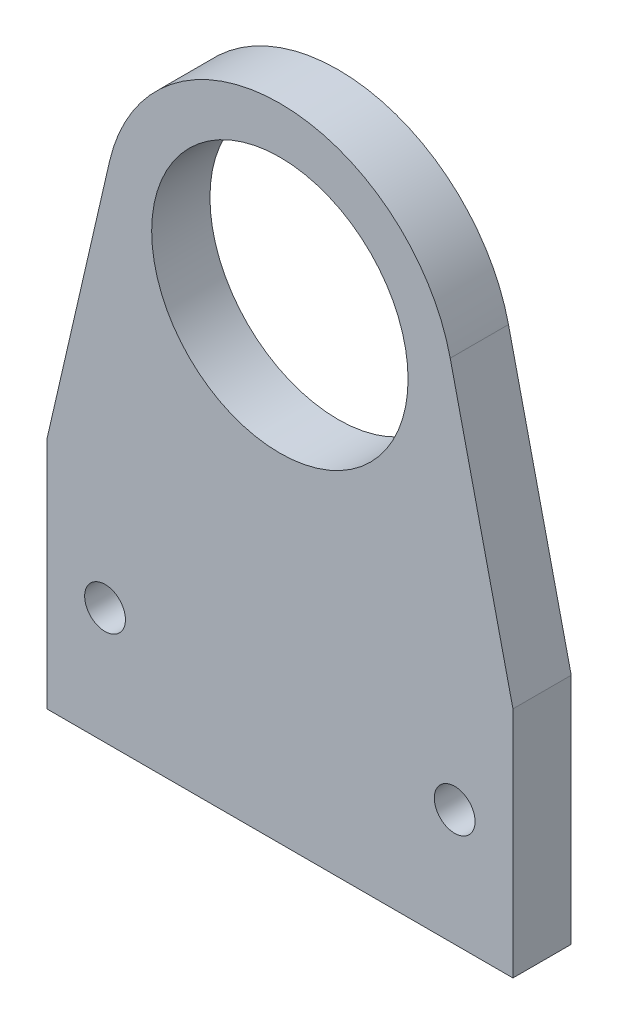
ISO-10303-21;
HEADER;
FILE_DESCRIPTION(('STEP AP214'),'2;1');
FILE_NAME('part.step','',(''),(''),'','','');
FILE_SCHEMA(('AUTOMOTIVE_DESIGN { 1 0 10303 214 1 1 1 1 }'));
ENDSEC;
DATA;
#1=APPLICATION_CONTEXT('core data for automotive mechanical design processes');
#2=APPLICATION_PROTOCOL_DEFINITION('international standard','automotive_design',2000,#1);
#3=PRODUCT_CONTEXT('',#1,'mechanical');
#4=PRODUCT('Part','Part','',(#3));
#5=PRODUCT_RELATED_PRODUCT_CATEGORY('part','',(#4));
#6=PRODUCT_DEFINITION_FORMATION('','',#4);
#7=PRODUCT_DEFINITION_CONTEXT('part definition',#1,'design');
#8=PRODUCT_DEFINITION('design','',#6,#7);
#9=PRODUCT_DEFINITION_SHAPE('','',#8);
#10=(LENGTH_UNIT() NAMED_UNIT(*) SI_UNIT(.MILLI.,.METRE.));
#11=(NAMED_UNIT(*) PLANE_ANGLE_UNIT() SI_UNIT($,.RADIAN.));
#12=(NAMED_UNIT(*) SI_UNIT($,.STERADIAN.) SOLID_ANGLE_UNIT());
#13=UNCERTAINTY_MEASURE_WITH_UNIT(LENGTH_MEASURE(1.E-05),#10,'distance_accuracy_value','');
#14=(GEOMETRIC_REPRESENTATION_CONTEXT(3) GLOBAL_UNCERTAINTY_ASSIGNED_CONTEXT((#13)) GLOBAL_UNIT_ASSIGNED_CONTEXT((#10,
#11,#12)) REPRESENTATION_CONTEXT('',''));
#15=CARTESIAN_POINT('',(0.,0.,0.));
#16=DIRECTION('',(0.,0.,1.));
#17=DIRECTION('',(1.,0.,0.));
#18=AXIS2_PLACEMENT_3D('',#15,#16,#17);
#19=CARTESIAN_POINT('',(0.,20.,5.));
#20=DIRECTION('',(0.,0.,1.));
#21=DIRECTION('',(1.,0.,0.));
#22=AXIS2_PLACEMENT_3D('',#19,#20,#21);
#23=PLANE('',#22);
#24=CARTESIAN_POINT('',(-15.,-10.,5.));
#25=DIRECTION('',(0.,0.,1.));
#26=DIRECTION('',(1.,0.,0.));
#27=AXIS2_PLACEMENT_3D('',#24,#25,#26);
#28=CIRCLE('',#27,1.75);
#29=CARTESIAN_POINT('',(-13.25,-10.,5.));
#30=VERTEX_POINT('',#29);
#31=EDGE_CURVE('E207',#30,#30,#28,.T.);
#32=ORIENTED_EDGE('',*,*,#31,.F.);
#33=EDGE_LOOP('',(#32));
#34=FACE_BOUND('',#33,.T.);
#35=CARTESIAN_POINT('',(0.,20.,5.));
#36=DIRECTION('',(0.,0.,1.));
#37=DIRECTION('',(1.,0.,0.));
#38=AXIS2_PLACEMENT_3D('',#35,#36,#37);
#39=CIRCLE('',#38,15.);
#40=CARTESIAN_POINT('',(14.6171841062113,23.3671841062113,5.));
#41=VERTEX_POINT('',#40);
#42=CARTESIAN_POINT('',(-14.6171841062113,23.3671841062113,5.));
#43=VERTEX_POINT('',#42);
#44=EDGE_CURVE('E146',#41,#43,#39,.T.);
#45=ORIENTED_EDGE('',*,*,#44,.T.);
#46=DIRECTION('',(-0.22447894041409,-0.97447894041409,0.));
#47=VECTOR('',#46,1.);
#48=CARTESIAN_POINT('',(-14.6171841062113,23.3671841062113,5.));
#49=LINE('',#48,#47);
#50=CARTESIAN_POINT('',(-20.,0.,5.));
#51=VERTEX_POINT('',#50);
#52=EDGE_CURVE('E94',#43,#51,#49,.T.);
#53=ORIENTED_EDGE('',*,*,#52,.T.);
#54=DIRECTION('',(0.,-1.,0.));
#55=VECTOR('',#54,1.);
#56=CARTESIAN_POINT('',(-20.,0.,5.));
#57=LINE('',#56,#55);
#58=CARTESIAN_POINT('',(-20.,-20.,5.));
#59=VERTEX_POINT('',#58);
#60=EDGE_CURVE('E107',#51,#59,#57,.T.);
#61=ORIENTED_EDGE('',*,*,#60,.T.);
#62=DIRECTION('',(1.,0.,0.));
#63=VECTOR('',#62,1.);
#64=CARTESIAN_POINT('',(-20.,-20.,5.));
#65=LINE('',#64,#63);
#66=CARTESIAN_POINT('',(20.,-20.,5.));
#67=VERTEX_POINT('',#66);
#68=EDGE_CURVE('E101',#59,#67,#65,.T.);
#69=ORIENTED_EDGE('',*,*,#68,.T.);
#70=DIRECTION('',(0.,1.,0.));
#71=VECTOR('',#70,1.);
#72=CARTESIAN_POINT('',(20.,-20.,5.));
#73=LINE('',#72,#71);
#74=CARTESIAN_POINT('',(20.,0.,5.));
#75=VERTEX_POINT('',#74);
#76=EDGE_CURVE('E105',#67,#75,#73,.T.);
#77=ORIENTED_EDGE('',*,*,#76,.T.);
#78=DIRECTION('',(-0.22447894041409,0.97447894041409,0.));
#79=VECTOR('',#78,1.);
#80=CARTESIAN_POINT('',(20.,0.,5.));
#81=LINE('',#80,#79);
#82=EDGE_CURVE('E57',#75,#41,#81,.T.);
#83=ORIENTED_EDGE('',*,*,#82,.T.);
#84=EDGE_LOOP('',(#45,#53,#61,#69,#77,#83));
#85=FACE_BOUND('',#84,.T.);
#86=CARTESIAN_POINT('',(0.,20.,5.));
#87=DIRECTION('',(0.,0.,1.));
#88=DIRECTION('',(1.,0.,0.));
#89=AXIS2_PLACEMENT_3D('',#86,#87,#88);
#90=CIRCLE('',#89,11.);
#91=CARTESIAN_POINT('',(11.,20.,5.));
#92=VERTEX_POINT('',#91);
#93=EDGE_CURVE('E134',#92,#92,#90,.T.);
#94=ORIENTED_EDGE('',*,*,#93,.F.);
#95=EDGE_LOOP('',(#94));
#96=FACE_BOUND('',#95,.T.);
#97=CARTESIAN_POINT('',(15.,-10.,5.));
#98=DIRECTION('',(0.,0.,1.));
#99=DIRECTION('',(1.,0.,0.));
#100=AXIS2_PLACEMENT_3D('',#97,#98,#99);
#101=CIRCLE('',#100,1.75);
#102=CARTESIAN_POINT('',(16.75,-10.,5.));
#103=VERTEX_POINT('',#102);
#104=EDGE_CURVE('E196',#103,#103,#101,.T.);
#105=ORIENTED_EDGE('',*,*,#104,.F.);
#106=EDGE_LOOP('',(#105));
#107=FACE_BOUND('',#106,.T.);
#108=ADVANCED_FACE('F39',(#34,#85,#96,#107),#23,.T.);
#109=CARTESIAN_POINT('',(0.,20.,0.));
#110=DIRECTION('',(0.,0.,1.));
#111=DIRECTION('',(1.,0.,0.));
#112=AXIS2_PLACEMENT_3D('',#109,#110,#111);
#113=PLANE('',#112);
#114=CARTESIAN_POINT('',(0.,20.,0.));
#115=DIRECTION('',(0.,0.,1.));
#116=DIRECTION('',(1.,0.,0.));
#117=AXIS2_PLACEMENT_3D('',#114,#115,#116);
#118=CIRCLE('',#117,15.);
#119=CARTESIAN_POINT('',(14.6171841062113,23.3671841062113,0.));
#120=VERTEX_POINT('',#119);
#121=CARTESIAN_POINT('',(-14.6171841062113,23.3671841062113,0.));
#122=VERTEX_POINT('',#121);
#123=EDGE_CURVE('E129',#120,#122,#118,.T.);
#124=ORIENTED_EDGE('',*,*,#123,.F.);
#125=DIRECTION('',(-0.22447894041409,0.97447894041409,0.));
#126=VECTOR('',#125,1.);
#127=CARTESIAN_POINT('',(20.,0.,0.));
#128=LINE('',#127,#126);
#129=CARTESIAN_POINT('',(20.,0.,0.));
#130=VERTEX_POINT('',#129);
#131=EDGE_CURVE('E86',#130,#120,#128,.T.);
#132=ORIENTED_EDGE('',*,*,#131,.F.);
#133=DIRECTION('',(0.,1.,0.));
#134=VECTOR('',#133,1.);
#135=CARTESIAN_POINT('',(20.,-20.,0.));
#136=LINE('',#135,#134);
#137=CARTESIAN_POINT('',(20.,-20.,0.));
#138=VERTEX_POINT('',#137);
#139=EDGE_CURVE('E80',#138,#130,#136,.T.);
#140=ORIENTED_EDGE('',*,*,#139,.F.);
#141=DIRECTION('',(1.,0.,0.));
#142=VECTOR('',#141,1.);
#143=CARTESIAN_POINT('',(-20.,-20.,0.));
#144=LINE('',#143,#142);
#145=CARTESIAN_POINT('',(-20.,-20.,0.));
#146=VERTEX_POINT('',#145);
#147=EDGE_CURVE('E116',#146,#138,#144,.T.);
#148=ORIENTED_EDGE('',*,*,#147,.F.);
#149=DIRECTION('',(0.,-1.,0.));
#150=VECTOR('',#149,1.);
#151=CARTESIAN_POINT('',(-20.,0.,0.));
#152=LINE('',#151,#150);
#153=CARTESIAN_POINT('',(-20.,0.,0.));
#154=VERTEX_POINT('',#153);
#155=EDGE_CURVE('E137',#154,#146,#152,.T.);
#156=ORIENTED_EDGE('',*,*,#155,.F.);
#157=DIRECTION('',(-0.22447894041409,-0.97447894041409,0.));
#158=VECTOR('',#157,1.);
#159=CARTESIAN_POINT('',(-14.6171841062113,23.3671841062113,0.));
#160=LINE('',#159,#158);
#161=EDGE_CURVE('E133',#122,#154,#160,.T.);
#162=ORIENTED_EDGE('',*,*,#161,.F.);
#163=EDGE_LOOP('',(#124,#132,#140,#148,#156,#162));
#164=FACE_BOUND('',#163,.T.);
#165=CARTESIAN_POINT('',(0.,20.,0.));
#166=DIRECTION('',(0.,0.,1.));
#167=DIRECTION('',(1.,0.,0.));
#168=AXIS2_PLACEMENT_3D('',#165,#166,#167);
#169=CIRCLE('',#168,11.);
#170=CARTESIAN_POINT('',(11.,20.,0.));
#171=VERTEX_POINT('',#170);
#172=EDGE_CURVE('E211',#171,#171,#169,.T.);
#173=ORIENTED_EDGE('',*,*,#172,.T.);
#174=EDGE_LOOP('',(#173));
#175=FACE_BOUND('',#174,.T.);
#176=CARTESIAN_POINT('',(-15.,-10.,0.));
#177=DIRECTION('',(0.,0.,1.));
#178=DIRECTION('',(1.,0.,0.));
#179=AXIS2_PLACEMENT_3D('',#176,#177,#178);
#180=CIRCLE('',#179,1.75);
#181=CARTESIAN_POINT('',(-13.25,-10.,0.));
#182=VERTEX_POINT('',#181);
#183=EDGE_CURVE('E204',#182,#182,#180,.T.);
#184=ORIENTED_EDGE('',*,*,#183,.T.);
#185=EDGE_LOOP('',(#184));
#186=FACE_BOUND('',#185,.T.);
#187=CARTESIAN_POINT('',(15.,-10.,0.));
#188=DIRECTION('',(0.,0.,1.));
#189=DIRECTION('',(1.,0.,0.));
#190=AXIS2_PLACEMENT_3D('',#187,#188,#189);
#191=CIRCLE('',#190,1.75);
#192=CARTESIAN_POINT('',(16.75,-10.,0.));
#193=VERTEX_POINT('',#192);
#194=EDGE_CURVE('E199',#193,#193,#191,.T.);
#195=ORIENTED_EDGE('',*,*,#194,.T.);
#196=EDGE_LOOP('',(#195));
#197=FACE_BOUND('',#196,.T.);
#198=ADVANCED_FACE('F159',(#164,#175,#186,#197),#113,.F.);
#199=CARTESIAN_POINT('',(0.,20.,5.));
#200=DIRECTION('',(0.,0.,-1.));
#201=DIRECTION('',(-1.,0.,0.));
#202=AXIS2_PLACEMENT_3D('',#199,#200,#201);
#203=CYLINDRICAL_SURFACE('',#202,15.);
#204=ORIENTED_EDGE('',*,*,#123,.T.);
#205=DIRECTION('',(0.,0.,-1.));
#206=VECTOR('',#205,1.);
#207=CARTESIAN_POINT('',(-14.6171841062113,23.3671841062113,5.));
#208=LINE('',#207,#206);
#209=EDGE_CURVE('E11',#43,#122,#208,.T.);
#210=ORIENTED_EDGE('',*,*,#209,.F.);
#211=ORIENTED_EDGE('',*,*,#44,.F.);
#212=DIRECTION('',(0.,0.,-1.));
#213=VECTOR('',#212,1.);
#214=CARTESIAN_POINT('',(14.6171841062113,23.3671841062113,5.));
#215=LINE('',#214,#213);
#216=EDGE_CURVE('E125',#41,#120,#215,.T.);
#217=ORIENTED_EDGE('',*,*,#216,.T.);
#218=EDGE_LOOP('',(#204,#210,#211,#217));
#219=FACE_BOUND('',#218,.T.);
#220=ADVANCED_FACE('F41',(#219),#203,.T.);
#221=CARTESIAN_POINT('',(-14.6171841062113,23.3671841062113,5.));
#222=DIRECTION('',(0.97447894041409,-0.22447894041409,0.));
#223=DIRECTION('',(0.22447894041409,0.97447894041409,0.));
#224=AXIS2_PLACEMENT_3D('',#221,#222,#223);
#225=PLANE('',#224);
#226=ORIENTED_EDGE('',*,*,#161,.T.);
#227=DIRECTION('',(0.,0.,-1.));
#228=VECTOR('',#227,1.);
#229=CARTESIAN_POINT('',(-20.,0.,5.));
#230=LINE('',#229,#228);
#231=EDGE_CURVE('E49',#51,#154,#230,.T.);
#232=ORIENTED_EDGE('',*,*,#231,.F.);
#233=ORIENTED_EDGE('',*,*,#52,.F.);
#234=ORIENTED_EDGE('',*,*,#209,.T.);
#235=EDGE_LOOP('',(#226,#232,#233,#234));
#236=FACE_BOUND('',#235,.T.);
#237=ADVANCED_FACE('F267',(#236),#225,.F.);
#238=CARTESIAN_POINT('',(-20.,0.,5.));
#239=DIRECTION('',(1.,0.,0.));
#240=DIRECTION('',(0.,0.,-1.));
#241=AXIS2_PLACEMENT_3D('',#238,#239,#240);
#242=PLANE('',#241);
#243=ORIENTED_EDGE('',*,*,#155,.T.);
#244=DIRECTION('',(0.,0.,-1.));
#245=VECTOR('',#244,1.);
#246=CARTESIAN_POINT('',(-20.,-20.,5.));
#247=LINE('',#246,#245);
#248=EDGE_CURVE('E118',#59,#146,#247,.T.);
#249=ORIENTED_EDGE('',*,*,#248,.F.);
#250=ORIENTED_EDGE('',*,*,#60,.F.);
#251=ORIENTED_EDGE('',*,*,#231,.T.);
#252=EDGE_LOOP('',(#243,#249,#250,#251));
#253=FACE_BOUND('',#252,.T.);
#254=ADVANCED_FACE('F156',(#253),#242,.F.);
#255=CARTESIAN_POINT('',(-20.,-20.,5.));
#256=DIRECTION('',(0.,1.,0.));
#257=DIRECTION('',(-1.,0.,0.));
#258=AXIS2_PLACEMENT_3D('',#255,#256,#257);
#259=PLANE('',#258);
#260=ORIENTED_EDGE('',*,*,#147,.T.);
#261=DIRECTION('',(0.,0.,-1.));
#262=VECTOR('',#261,1.);
#263=CARTESIAN_POINT('',(20.,-20.,5.));
#264=LINE('',#263,#262);
#265=EDGE_CURVE('E113',#67,#138,#264,.T.);
#266=ORIENTED_EDGE('',*,*,#265,.F.);
#267=ORIENTED_EDGE('',*,*,#68,.F.);
#268=ORIENTED_EDGE('',*,*,#248,.T.);
#269=EDGE_LOOP('',(#260,#266,#267,#268));
#270=FACE_BOUND('',#269,.T.);
#271=ADVANCED_FACE('F114',(#270),#259,.F.);
#272=CARTESIAN_POINT('',(20.,-20.,5.));
#273=DIRECTION('',(-1.,0.,0.));
#274=DIRECTION('',(0.,0.,1.));
#275=AXIS2_PLACEMENT_3D('',#272,#273,#274);
#276=PLANE('',#275);
#277=ORIENTED_EDGE('',*,*,#139,.T.);
#278=DIRECTION('',(0.,0.,-1.));
#279=VECTOR('',#278,1.);
#280=CARTESIAN_POINT('',(20.,0.,5.));
#281=LINE('',#280,#279);
#282=EDGE_CURVE('E119',#75,#130,#281,.T.);
#283=ORIENTED_EDGE('',*,*,#282,.F.);
#284=ORIENTED_EDGE('',*,*,#76,.F.);
#285=ORIENTED_EDGE('',*,*,#265,.T.);
#286=EDGE_LOOP('',(#277,#283,#284,#285));
#287=FACE_BOUND('',#286,.T.);
#288=ADVANCED_FACE('F121',(#287),#276,.F.);
#289=CARTESIAN_POINT('',(20.,0.,5.));
#290=DIRECTION('',(-0.97447894041409,-0.22447894041409,0.));
#291=DIRECTION('',(0.22447894041409,-0.97447894041409,0.));
#292=AXIS2_PLACEMENT_3D('',#289,#290,#291);
#293=PLANE('',#292);
#294=ORIENTED_EDGE('',*,*,#131,.T.);
#295=ORIENTED_EDGE('',*,*,#216,.F.);
#296=ORIENTED_EDGE('',*,*,#82,.F.);
#297=ORIENTED_EDGE('',*,*,#282,.T.);
#298=EDGE_LOOP('',(#294,#295,#296,#297));
#299=FACE_BOUND('',#298,.T.);
#300=ADVANCED_FACE('F164',(#299),#293,.F.);
#301=CARTESIAN_POINT('',(0.,20.,5.));
#302=DIRECTION('',(0.,0.,-1.));
#303=DIRECTION('',(-1.,0.,0.));
#304=AXIS2_PLACEMENT_3D('',#301,#302,#303);
#305=CYLINDRICAL_SURFACE('',#304,11.);
#306=ORIENTED_EDGE('',*,*,#93,.T.);
#307=EDGE_LOOP('',(#306));
#308=FACE_BOUND('',#307,.T.);
#309=ORIENTED_EDGE('',*,*,#172,.F.);
#310=EDGE_LOOP('',(#309));
#311=FACE_BOUND('',#310,.T.);
#312=ADVANCED_FACE('F166',(#308,#311),#305,.F.);
#313=CARTESIAN_POINT('',(-15.,-10.,5.));
#314=DIRECTION('',(0.,0.,-1.));
#315=DIRECTION('',(-1.,0.,0.));
#316=AXIS2_PLACEMENT_3D('',#313,#314,#315);
#317=CYLINDRICAL_SURFACE('',#316,1.75);
#318=ORIENTED_EDGE('',*,*,#31,.T.);
#319=EDGE_LOOP('',(#318));
#320=FACE_BOUND('',#319,.T.);
#321=ORIENTED_EDGE('',*,*,#183,.F.);
#322=EDGE_LOOP('',(#321));
#323=FACE_BOUND('',#322,.T.);
#324=ADVANCED_FACE('F172',(#320,#323),#317,.F.);
#325=CARTESIAN_POINT('',(15.,-10.,5.));
#326=DIRECTION('',(0.,0.,-1.));
#327=DIRECTION('',(-1.,0.,0.));
#328=AXIS2_PLACEMENT_3D('',#325,#326,#327);
#329=CYLINDRICAL_SURFACE('',#328,1.75);
#330=ORIENTED_EDGE('',*,*,#104,.T.);
#331=EDGE_LOOP('',(#330));
#332=FACE_BOUND('',#331,.T.);
#333=ORIENTED_EDGE('',*,*,#194,.F.);
#334=EDGE_LOOP('',(#333));
#335=FACE_BOUND('',#334,.T.);
#336=ADVANCED_FACE('F187',(#332,#335),#329,.F.);
#337=CLOSED_SHELL('',(#108,#198,#220,#237,#254,#271,#288,#300,#312,#324,#336));
#338=MANIFOLD_SOLID_BREP('B2',#337);
#339=ADVANCED_BREP_SHAPE_REPRESENTATION('',(#18,#338),#14);
#340=SHAPE_DEFINITION_REPRESENTATION(#9,#339);
ENDSEC;
END-ISO-10303-21;
